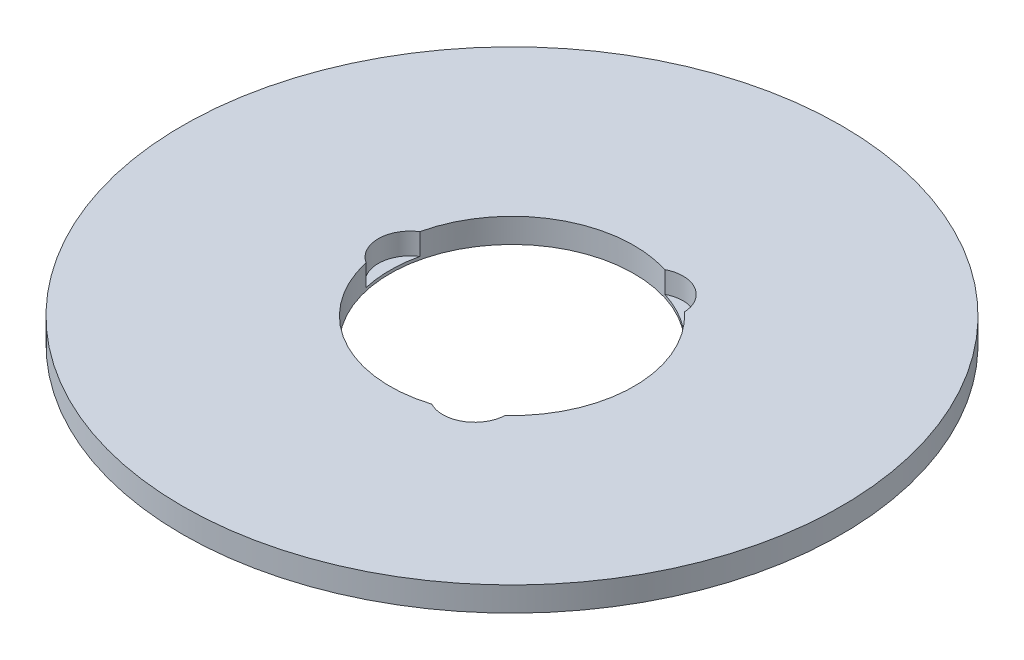
ISO-10303-21;
HEADER;
FILE_DESCRIPTION(('STEP AP214'),'2;1');
FILE_NAME('part.step','',(''),(''),'','','');
FILE_SCHEMA(('AUTOMOTIVE_DESIGN { 1 0 10303 214 1 1 1 1 }'));
ENDSEC;
DATA;
#1=APPLICATION_CONTEXT('core data for automotive mechanical design processes');
#2=APPLICATION_PROTOCOL_DEFINITION('international standard','automotive_design',2000,#1);
#3=PRODUCT_CONTEXT('',#1,'mechanical');
#4=PRODUCT('Part','Part','',(#3));
#5=PRODUCT_RELATED_PRODUCT_CATEGORY('part','',(#4));
#6=PRODUCT_DEFINITION_FORMATION('','',#4);
#7=PRODUCT_DEFINITION_CONTEXT('part definition',#1,'design');
#8=PRODUCT_DEFINITION('design','',#6,#7);
#9=PRODUCT_DEFINITION_SHAPE('','',#8);
#10=(LENGTH_UNIT() NAMED_UNIT(*) SI_UNIT(.MILLI.,.METRE.));
#11=(NAMED_UNIT(*) PLANE_ANGLE_UNIT() SI_UNIT($,.RADIAN.));
#12=(NAMED_UNIT(*) SI_UNIT($,.STERADIAN.) SOLID_ANGLE_UNIT());
#13=UNCERTAINTY_MEASURE_WITH_UNIT(LENGTH_MEASURE(1.E-05),#10,'distance_accuracy_value','');
#14=(GEOMETRIC_REPRESENTATION_CONTEXT(3) GLOBAL_UNCERTAINTY_ASSIGNED_CONTEXT((#13)) GLOBAL_UNIT_ASSIGNED_CONTEXT((#10,
#11,#12)) REPRESENTATION_CONTEXT('',''));
#15=CARTESIAN_POINT('',(0.,0.,0.));
#16=DIRECTION('',(0.,0.,1.));
#17=DIRECTION('',(1.,0.,0.));
#18=AXIS2_PLACEMENT_3D('',#15,#16,#17);
#19=CARTESIAN_POINT('',(0.,5.,0.));
#20=DIRECTION('',(0.,-1.,0.));
#21=DIRECTION('',(0.,0.,-1.));
#22=AXIS2_PLACEMENT_3D('',#19,#20,#21);
#23=CYLINDRICAL_SURFACE('',#22,67.5);
#24=CARTESIAN_POINT('',(0.,5.,0.));
#25=DIRECTION('',(0.,1.,0.));
#26=DIRECTION('',(0.,0.,1.));
#27=AXIS2_PLACEMENT_3D('',#24,#25,#26);
#28=CIRCLE('',#27,67.5);
#29=CARTESIAN_POINT('',(0.,5.,67.5));
#30=VERTEX_POINT('',#29);
#31=EDGE_CURVE('E130',#30,#30,#28,.T.);
#32=ORIENTED_EDGE('',*,*,#31,.F.);
#33=EDGE_LOOP('',(#32));
#34=FACE_BOUND('',#33,.T.);
#35=CARTESIAN_POINT('',(0.,0.,0.));
#36=DIRECTION('',(0.,1.,0.));
#37=DIRECTION('',(0.,0.,1.));
#38=AXIS2_PLACEMENT_3D('',#35,#36,#37);
#39=CIRCLE('',#38,67.5);
#40=CARTESIAN_POINT('',(0.,0.,67.5));
#41=VERTEX_POINT('',#40);
#42=EDGE_CURVE('E117',#41,#41,#39,.T.);
#43=ORIENTED_EDGE('',*,*,#42,.T.);
#44=EDGE_LOOP('',(#43));
#45=FACE_BOUND('',#44,.T.);
#46=ADVANCED_FACE('F39',(#34,#45),#23,.T.);
#47=CARTESIAN_POINT('',(0.,5.,0.));
#48=DIRECTION('',(0.,1.,0.));
#49=DIRECTION('',(0.,0.,1.));
#50=AXIS2_PLACEMENT_3D('',#47,#48,#49);
#51=PLANE('',#50);
#52=CARTESIAN_POINT('',(10.4296988737969,5.,18.06476835706));
#53=DIRECTION('',(0.,1.,0.));
#54=DIRECTION('',(0.866025403784436,0.,-0.500000000000004));
#55=AXIS2_PLACEMENT_3D('',#52,#53,#54);
#56=CIRCLE('',#55,6.5363278208763);
#57=CARTESIAN_POINT('',(7.42789427065576,5.,23.8710365653434));
#58=VERTEX_POINT('',#57);
#59=CARTESIAN_POINT('',(16.9589769449269,5.,18.3682634176843));
#60=VERTEX_POINT('',#59);
#61=EDGE_CURVE('E148',#58,#60,#56,.T.);
#62=ORIENTED_EDGE('',*,*,#61,.F.);
#63=CARTESIAN_POINT('',(0.,5.,0.));
#64=DIRECTION('',(0.,1.,0.));
#65=DIRECTION('',(0.,0.,1.));
#66=AXIS2_PLACEMENT_3D('',#63,#64,#65);
#67=CIRCLE('',#66,25.);
#68=CARTESIAN_POINT('',(-24.3868712155824,5.,5.50277314765901));
#69=VERTEX_POINT('',#68);
#70=EDGE_CURVE('E113',#69,#58,#67,.T.);
#71=ORIENTED_EDGE('',*,*,#70,.F.);
#72=CARTESIAN_POINT('',(-20.8593977475937,5.,0.));
#73=DIRECTION('',(0.,1.,0.));
#74=DIRECTION('',(0.,0.,1.));
#75=AXIS2_PLACEMENT_3D('',#72,#73,#74);
#76=CIRCLE('',#75,6.5363278208763);
#77=CARTESIAN_POINT('',(-24.3868712155824,5.,-5.50277314765901));
#78=VERTEX_POINT('',#77);
#79=EDGE_CURVE('E125',#78,#69,#76,.T.);
#80=ORIENTED_EDGE('',*,*,#79,.F.);
#81=CARTESIAN_POINT('',(7.42789427065543,5.,-23.8710365653435));
#82=VERTEX_POINT('',#81);
#83=EDGE_CURVE('E107',#82,#78,#67,.T.);
#84=ORIENTED_EDGE('',*,*,#83,.F.);
#85=CARTESIAN_POINT('',(10.4296988737967,5.,-18.0647683570601));
#86=DIRECTION('',(0.,1.,0.));
#87=DIRECTION('',(-0.866025403784443,0.,-0.499999999999992));
#88=AXIS2_PLACEMENT_3D('',#85,#86,#87);
#89=CIRCLE('',#88,6.5363278208763);
#90=CARTESIAN_POINT('',(16.9589769449266,5.,-18.3682634176845));
#91=VERTEX_POINT('',#90);
#92=EDGE_CURVE('E95',#91,#82,#89,.T.);
#93=ORIENTED_EDGE('',*,*,#92,.F.);
#94=EDGE_CURVE('E106',#60,#91,#67,.T.);
#95=ORIENTED_EDGE('',*,*,#94,.F.);
#96=EDGE_LOOP('',(#62,#71,#80,#84,#93,#95));
#97=FACE_BOUND('',#96,.T.);
#98=ORIENTED_EDGE('',*,*,#31,.T.);
#99=EDGE_LOOP('',(#98));
#100=FACE_BOUND('',#99,.T.);
#101=ADVANCED_FACE('F102',(#97,#100),#51,.T.);
#102=CARTESIAN_POINT('',(0.,0.,0.));
#103=DIRECTION('',(0.,1.,0.));
#104=DIRECTION('',(0.,0.,1.));
#105=AXIS2_PLACEMENT_3D('',#102,#103,#104);
#106=PLANE('',#105);
#107=CARTESIAN_POINT('',(0.,0.,0.));
#108=DIRECTION('',(0.,1.,0.));
#109=DIRECTION('',(0.,0.,1.));
#110=AXIS2_PLACEMENT_3D('',#107,#108,#109);
#111=CIRCLE('',#110,25.);
#112=CARTESIAN_POINT('',(0.,0.,25.));
#113=VERTEX_POINT('',#112);
#114=EDGE_CURVE('E118',#113,#113,#111,.T.);
#115=ORIENTED_EDGE('',*,*,#114,.T.);
#116=EDGE_LOOP('',(#115));
#117=FACE_BOUND('',#116,.T.);
#118=ORIENTED_EDGE('',*,*,#42,.F.);
#119=EDGE_LOOP('',(#118));
#120=FACE_BOUND('',#119,.T.);
#121=ADVANCED_FACE('F161',(#117,#120),#106,.F.);
#122=CARTESIAN_POINT('',(0.,5.,0.));
#123=DIRECTION('',(0.,-1.,0.));
#124=DIRECTION('',(0.,0.,-1.));
#125=AXIS2_PLACEMENT_3D('',#122,#123,#124);
#126=CYLINDRICAL_SURFACE('',#125,25.);
#127=DIRECTION('',(0.,1.,0.));
#128=VECTOR('',#127,1.);
#129=CARTESIAN_POINT('',(7.42789427065576,2.79992896412444,23.8710365653434));
#130=LINE('',#129,#128);
#131=CARTESIAN_POINT('',(7.42789427065576,0.599857928248884,23.8710365653434));
#132=VERTEX_POINT('',#131);
#133=EDGE_CURVE('E11',#132,#58,#130,.T.);
#134=ORIENTED_EDGE('',*,*,#133,.F.);
#135=CARTESIAN_POINT('',(0.,0.599857928248884,0.));
#136=DIRECTION('',(0.,1.,0.));
#137=DIRECTION('',(0.,0.,1.));
#138=AXIS2_PLACEMENT_3D('',#135,#136,#137);
#139=CIRCLE('',#138,25.);
#140=CARTESIAN_POINT('',(16.9589769449269,0.599857928248884,18.3682634176843));
#141=VERTEX_POINT('',#140);
#142=EDGE_CURVE('E100',#132,#141,#139,.T.);
#143=ORIENTED_EDGE('',*,*,#142,.T.);
#144=DIRECTION('',(0.,1.,0.));
#145=VECTOR('',#144,1.);
#146=CARTESIAN_POINT('',(16.9589769449269,2.79992896412444,18.3682634176843));
#147=LINE('',#146,#145);
#148=EDGE_CURVE('E46',#60,#141,#147,.F.);
#149=ORIENTED_EDGE('',*,*,#148,.F.);
#150=ORIENTED_EDGE('',*,*,#94,.T.);
#151=DIRECTION('',(0.,1.,0.));
#152=VECTOR('',#151,1.);
#153=CARTESIAN_POINT('',(16.9589769449266,2.79992896412444,-18.3682634176845));
#154=LINE('',#153,#152);
#155=CARTESIAN_POINT('',(16.9589769449266,0.599857928248884,-18.3682634176845));
#156=VERTEX_POINT('',#155);
#157=EDGE_CURVE('E90',#156,#91,#154,.T.);
#158=ORIENTED_EDGE('',*,*,#157,.F.);
#159=CARTESIAN_POINT('',(0.,0.599857928248884,0.));
#160=DIRECTION('',(0.,1.,0.));
#161=DIRECTION('',(0.,0.,1.));
#162=AXIS2_PLACEMENT_3D('',#159,#160,#161);
#163=CIRCLE('',#162,25.);
#164=CARTESIAN_POINT('',(7.42789427065543,0.599857928248884,-23.8710365653435));
#165=VERTEX_POINT('',#164);
#166=EDGE_CURVE('E143',#156,#165,#163,.T.);
#167=ORIENTED_EDGE('',*,*,#166,.T.);
#168=DIRECTION('',(0.,1.,0.));
#169=VECTOR('',#168,1.);
#170=CARTESIAN_POINT('',(7.42789427065543,2.79992896412444,-23.8710365653435));
#171=LINE('',#170,#169);
#172=EDGE_CURVE('E98',#82,#165,#171,.F.);
#173=ORIENTED_EDGE('',*,*,#172,.F.);
#174=ORIENTED_EDGE('',*,*,#83,.T.);
#175=DIRECTION('',(0.,1.,0.));
#176=VECTOR('',#175,1.);
#177=CARTESIAN_POINT('',(-24.3868712155824,2.79992896412444,-5.50277314765902));
#178=LINE('',#177,#176);
#179=CARTESIAN_POINT('',(-24.3868712155824,0.599857928248884,-5.50277314765901));
#180=VERTEX_POINT('',#179);
#181=EDGE_CURVE('E137',#180,#78,#178,.T.);
#182=ORIENTED_EDGE('',*,*,#181,.F.);
#183=CARTESIAN_POINT('',(0.,0.599857928248884,0.));
#184=DIRECTION('',(0.,1.,0.));
#185=DIRECTION('',(0.,0.,1.));
#186=AXIS2_PLACEMENT_3D('',#183,#184,#185);
#187=CIRCLE('',#186,25.);
#188=CARTESIAN_POINT('',(-24.3868712155824,0.599857928248884,5.50277314765901));
#189=VERTEX_POINT('',#188);
#190=EDGE_CURVE('E128',#180,#189,#187,.T.);
#191=ORIENTED_EDGE('',*,*,#190,.T.);
#192=DIRECTION('',(0.,1.,0.));
#193=VECTOR('',#192,1.);
#194=CARTESIAN_POINT('',(-24.3868712155824,2.79992896412444,5.50277314765902));
#195=LINE('',#194,#193);
#196=EDGE_CURVE('E134',#69,#189,#195,.F.);
#197=ORIENTED_EDGE('',*,*,#196,.F.);
#198=ORIENTED_EDGE('',*,*,#70,.T.);
#199=EDGE_LOOP('',(#134,#143,#149,#150,#158,#167,#173,#174,#182,#191,#197,#198));
#200=FACE_BOUND('',#199,.T.);
#201=ORIENTED_EDGE('',*,*,#114,.F.);
#202=EDGE_LOOP('',(#201));
#203=FACE_BOUND('',#202,.T.);
#204=ADVANCED_FACE('F115',(#200,#203),#126,.F.);
#205=CARTESIAN_POINT('',(-20.8593977475937,0.599857928248884,0.));
#206=DIRECTION('',(0.,1.,0.));
#207=DIRECTION('',(0.,0.,1.));
#208=AXIS2_PLACEMENT_3D('',#205,#206,#207);
#209=CYLINDRICAL_SURFACE('',#208,6.5363278208763);
#210=ORIENTED_EDGE('',*,*,#181,.T.);
#211=ORIENTED_EDGE('',*,*,#79,.T.);
#212=ORIENTED_EDGE('',*,*,#196,.T.);
#213=CARTESIAN_POINT('',(-20.8593977475937,0.599857928248884,0.));
#214=DIRECTION('',(0.,1.,0.));
#215=DIRECTION('',(0.,0.,1.));
#216=AXIS2_PLACEMENT_3D('',#213,#214,#215);
#217=CIRCLE('',#216,6.5363278208763);
#218=EDGE_CURVE('E127',#180,#189,#217,.T.);
#219=ORIENTED_EDGE('',*,*,#218,.F.);
#220=EDGE_LOOP('',(#210,#211,#212,#219));
#221=FACE_BOUND('',#220,.T.);
#222=ADVANCED_FACE('F175',(#221),#209,.F.);
#223=CARTESIAN_POINT('',(-20.8593977475937,0.599857928248884,0.));
#224=DIRECTION('',(0.,1.,0.));
#225=DIRECTION('',(0.,0.,1.));
#226=AXIS2_PLACEMENT_3D('',#223,#224,#225);
#227=PLANE('',#226);
#228=ORIENTED_EDGE('',*,*,#218,.T.);
#229=ORIENTED_EDGE('',*,*,#190,.F.);
#230=EDGE_LOOP('',(#228,#229));
#231=FACE_BOUND('',#230,.T.);
#232=ADVANCED_FACE('F176',(#231),#227,.T.);
#233=CARTESIAN_POINT('',(10.4296988737967,0.599857928248884,-18.0647683570601));
#234=DIRECTION('',(0.,1.,0.));
#235=DIRECTION('',(0.,0.,1.));
#236=AXIS2_PLACEMENT_3D('',#233,#234,#235);
#237=CYLINDRICAL_SURFACE('',#236,6.5363278208763);
#238=ORIENTED_EDGE('',*,*,#157,.T.);
#239=ORIENTED_EDGE('',*,*,#92,.T.);
#240=ORIENTED_EDGE('',*,*,#172,.T.);
#241=CARTESIAN_POINT('',(10.4296988737967,0.599857928248884,-18.0647683570601));
#242=DIRECTION('',(0.,1.,0.));
#243=DIRECTION('',(-0.866025403784443,0.,-0.499999999999992));
#244=AXIS2_PLACEMENT_3D('',#241,#242,#243);
#245=CIRCLE('',#244,6.5363278208763);
#246=EDGE_CURVE('E56',#156,#165,#245,.T.);
#247=ORIENTED_EDGE('',*,*,#246,.F.);
#248=EDGE_LOOP('',(#238,#239,#240,#247));
#249=FACE_BOUND('',#248,.T.);
#250=ADVANCED_FACE('F93',(#249),#237,.F.);
#251=CARTESIAN_POINT('',(10.4296988737967,0.599857928248884,-18.0647683570601));
#252=DIRECTION('',(0.,1.,0.));
#253=DIRECTION('',(-0.866025403784443,0.,-0.499999999999992));
#254=AXIS2_PLACEMENT_3D('',#251,#252,#253);
#255=PLANE('',#254);
#256=ORIENTED_EDGE('',*,*,#246,.T.);
#257=ORIENTED_EDGE('',*,*,#166,.F.);
#258=EDGE_LOOP('',(#256,#257));
#259=FACE_BOUND('',#258,.T.);
#260=ADVANCED_FACE('F153',(#259),#255,.T.);
#261=CARTESIAN_POINT('',(10.4296988737969,0.599857928248884,18.06476835706));
#262=DIRECTION('',(0.,1.,0.));
#263=DIRECTION('',(0.,0.,1.));
#264=AXIS2_PLACEMENT_3D('',#261,#262,#263);
#265=CYLINDRICAL_SURFACE('',#264,6.5363278208763);
#266=ORIENTED_EDGE('',*,*,#133,.T.);
#267=ORIENTED_EDGE('',*,*,#61,.T.);
#268=ORIENTED_EDGE('',*,*,#148,.T.);
#269=CARTESIAN_POINT('',(10.4296988737969,0.599857928248884,18.06476835706));
#270=DIRECTION('',(0.,1.,0.));
#271=DIRECTION('',(0.866025403784436,0.,-0.500000000000004));
#272=AXIS2_PLACEMENT_3D('',#269,#270,#271);
#273=CIRCLE('',#272,6.5363278208763);
#274=EDGE_CURVE('E55',#132,#141,#273,.T.);
#275=ORIENTED_EDGE('',*,*,#274,.F.);
#276=EDGE_LOOP('',(#266,#267,#268,#275));
#277=FACE_BOUND('',#276,.T.);
#278=ADVANCED_FACE('F144',(#277),#265,.F.);
#279=CARTESIAN_POINT('',(10.4296988737969,0.599857928248884,18.06476835706));
#280=DIRECTION('',(0.,1.,0.));
#281=DIRECTION('',(0.866025403784436,0.,-0.500000000000004));
#282=AXIS2_PLACEMENT_3D('',#279,#280,#281);
#283=PLANE('',#282);
#284=ORIENTED_EDGE('',*,*,#274,.T.);
#285=ORIENTED_EDGE('',*,*,#142,.F.);
#286=EDGE_LOOP('',(#284,#285));
#287=FACE_BOUND('',#286,.T.);
#288=ADVANCED_FACE('F150',(#287),#283,.T.);
#289=CLOSED_SHELL('',(#46,#101,#121,#204,#222,#232,#250,#260,#278,#288));
#290=MANIFOLD_SOLID_BREP('B2',#289);
#291=ADVANCED_BREP_SHAPE_REPRESENTATION('',(#18,#290),#14);
#292=SHAPE_DEFINITION_REPRESENTATION(#9,#291);
ENDSEC;
END-ISO-10303-21;
